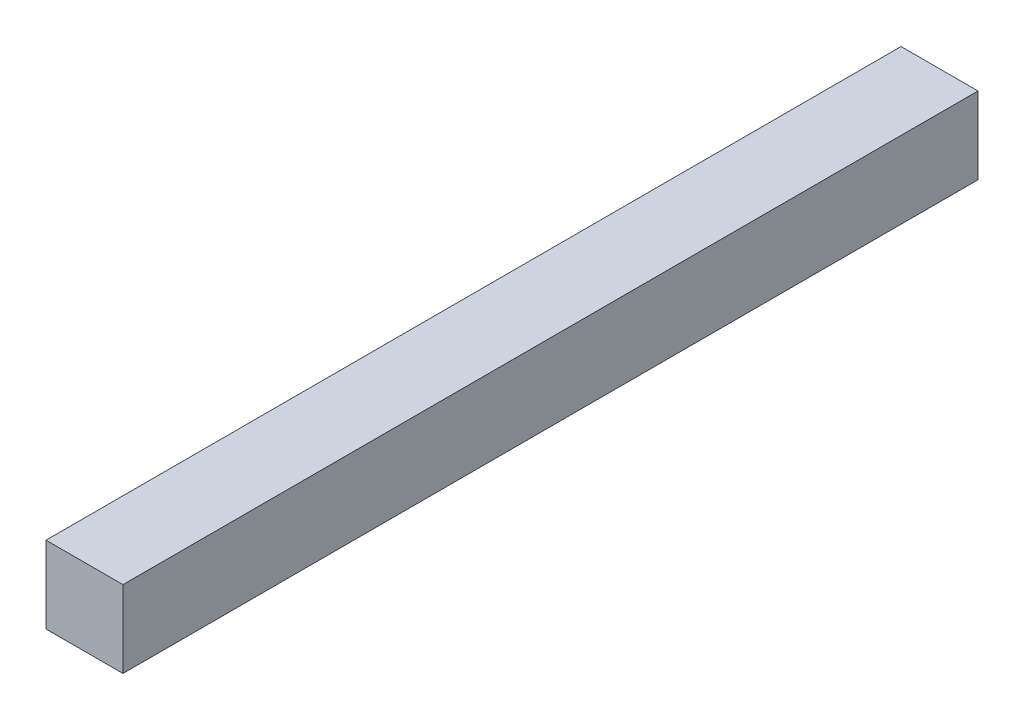
ISO-10303-21;
HEADER;
FILE_DESCRIPTION(('STEP AP214'),'2;1');
FILE_NAME('part.step','',(''),(''),'','','');
FILE_SCHEMA(('AUTOMOTIVE_DESIGN { 1 0 10303 214 1 1 1 1 }'));
ENDSEC;
DATA;
#1=APPLICATION_CONTEXT('core data for automotive mechanical design processes');
#2=APPLICATION_PROTOCOL_DEFINITION('international standard','automotive_design',2000,#1);
#3=PRODUCT_CONTEXT('',#1,'mechanical');
#4=PRODUCT('Part','Part','',(#3));
#5=PRODUCT_RELATED_PRODUCT_CATEGORY('part','',(#4));
#6=PRODUCT_DEFINITION_FORMATION('','',#4);
#7=PRODUCT_DEFINITION_CONTEXT('part definition',#1,'design');
#8=PRODUCT_DEFINITION('design','',#6,#7);
#9=PRODUCT_DEFINITION_SHAPE('','',#8);
#10=(LENGTH_UNIT() NAMED_UNIT(*) SI_UNIT(.MILLI.,.METRE.));
#11=(NAMED_UNIT(*) PLANE_ANGLE_UNIT() SI_UNIT($,.RADIAN.));
#12=(NAMED_UNIT(*) SI_UNIT($,.STERADIAN.) SOLID_ANGLE_UNIT());
#13=UNCERTAINTY_MEASURE_WITH_UNIT(LENGTH_MEASURE(1.E-05),#10,'distance_accuracy_value','');
#14=(GEOMETRIC_REPRESENTATION_CONTEXT(3) GLOBAL_UNCERTAINTY_ASSIGNED_CONTEXT((#13)) GLOBAL_UNIT_ASSIGNED_CONTEXT((#10,
#11,#12)) REPRESENTATION_CONTEXT('',''));
#15=CARTESIAN_POINT('',(0.,0.,0.));
#16=DIRECTION('',(0.,0.,1.));
#17=DIRECTION('',(1.,0.,0.));
#18=AXIS2_PLACEMENT_3D('',#15,#16,#17);
#19=CARTESIAN_POINT('',(0.,0.,-200.));
#20=DIRECTION('',(-1.,0.,0.));
#21=DIRECTION('',(0.,0.,1.));
#22=AXIS2_PLACEMENT_3D('',#19,#20,#21);
#23=PLANE('',#22);
#24=DIRECTION('',(0.,-1.,0.));
#25=VECTOR('',#24,1.);
#26=CARTESIAN_POINT('',(0.,0.,0.));
#27=LINE('',#26,#25);
#28=CARTESIAN_POINT('',(0.,18.,0.));
#29=VERTEX_POINT('',#28);
#30=CARTESIAN_POINT('',(0.,0.,0.));
#31=VERTEX_POINT('',#30);
#32=EDGE_CURVE('E95',#29,#31,#27,.T.);
#33=ORIENTED_EDGE('',*,*,#32,.F.);
#34=DIRECTION('',(0.,0.,1.));
#35=VECTOR('',#34,1.);
#36=CARTESIAN_POINT('',(0.,18.,-200.));
#37=LINE('',#36,#35);
#38=CARTESIAN_POINT('',(0.,18.,-200.));
#39=VERTEX_POINT('',#38);
#40=EDGE_CURVE('E11',#39,#29,#37,.T.);
#41=ORIENTED_EDGE('',*,*,#40,.F.);
#42=DIRECTION('',(0.,-1.,0.));
#43=VECTOR('',#42,1.);
#44=CARTESIAN_POINT('',(0.,0.,-200.));
#45=LINE('',#44,#43);
#46=CARTESIAN_POINT('',(0.,0.,-200.));
#47=VERTEX_POINT('',#46);
#48=EDGE_CURVE('E89',#39,#47,#45,.T.);
#49=ORIENTED_EDGE('',*,*,#48,.T.);
#50=DIRECTION('',(0.,0.,1.));
#51=VECTOR('',#50,1.);
#52=CARTESIAN_POINT('',(0.,0.,-200.));
#53=LINE('',#52,#51);
#54=EDGE_CURVE('E34',#47,#31,#53,.T.);
#55=ORIENTED_EDGE('',*,*,#54,.T.);
#56=EDGE_LOOP('',(#33,#41,#49,#55));
#57=FACE_BOUND('',#56,.T.);
#58=ADVANCED_FACE('F31',(#57),#23,.T.);
#59=CARTESIAN_POINT('',(0.,18.,-200.));
#60=DIRECTION('',(0.,1.,0.));
#61=DIRECTION('',(0.,0.,1.));
#62=AXIS2_PLACEMENT_3D('',#59,#60,#61);
#63=PLANE('',#62);
#64=DIRECTION('',(-1.,0.,0.));
#65=VECTOR('',#64,1.);
#66=CARTESIAN_POINT('',(0.,18.,0.));
#67=LINE('',#66,#65);
#68=CARTESIAN_POINT('',(18.,18.,0.));
#69=VERTEX_POINT('',#68);
#70=EDGE_CURVE('E91',#69,#29,#67,.T.);
#71=ORIENTED_EDGE('',*,*,#70,.F.);
#72=DIRECTION('',(0.,0.,1.));
#73=VECTOR('',#72,1.);
#74=CARTESIAN_POINT('',(18.,18.,-200.));
#75=LINE('',#74,#73);
#76=CARTESIAN_POINT('',(18.,18.,-200.));
#77=VERTEX_POINT('',#76);
#78=EDGE_CURVE('E40',#77,#69,#75,.T.);
#79=ORIENTED_EDGE('',*,*,#78,.F.);
#80=DIRECTION('',(-1.,0.,0.));
#81=VECTOR('',#80,1.);
#82=CARTESIAN_POINT('',(0.,18.,-200.));
#83=LINE('',#82,#81);
#84=EDGE_CURVE('E86',#77,#39,#83,.T.);
#85=ORIENTED_EDGE('',*,*,#84,.T.);
#86=ORIENTED_EDGE('',*,*,#40,.T.);
#87=EDGE_LOOP('',(#71,#79,#85,#86));
#88=FACE_BOUND('',#87,.T.);
#89=ADVANCED_FACE('F105',(#88),#63,.T.);
#90=CARTESIAN_POINT('',(18.,0.,-200.));
#91=DIRECTION('',(1.,0.,0.));
#92=DIRECTION('',(0.,0.,-1.));
#93=AXIS2_PLACEMENT_3D('',#90,#91,#92);
#94=PLANE('',#93);
#95=DIRECTION('',(0.,1.,0.));
#96=VECTOR('',#95,1.);
#97=CARTESIAN_POINT('',(18.,0.,0.));
#98=LINE('',#97,#96);
#99=CARTESIAN_POINT('',(18.,0.,0.));
#100=VERTEX_POINT('',#99);
#101=EDGE_CURVE('E81',#100,#69,#98,.T.);
#102=ORIENTED_EDGE('',*,*,#101,.F.);
#103=DIRECTION('',(0.,0.,1.));
#104=VECTOR('',#103,1.);
#105=CARTESIAN_POINT('',(18.,0.,-200.));
#106=LINE('',#105,#104);
#107=CARTESIAN_POINT('',(18.,0.,-200.));
#108=VERTEX_POINT('',#107);
#109=EDGE_CURVE('E76',#108,#100,#106,.T.);
#110=ORIENTED_EDGE('',*,*,#109,.F.);
#111=DIRECTION('',(0.,1.,0.));
#112=VECTOR('',#111,1.);
#113=CARTESIAN_POINT('',(18.,0.,-200.));
#114=LINE('',#113,#112);
#115=EDGE_CURVE('E79',#108,#77,#114,.T.);
#116=ORIENTED_EDGE('',*,*,#115,.T.);
#117=ORIENTED_EDGE('',*,*,#78,.T.);
#118=EDGE_LOOP('',(#102,#110,#116,#117));
#119=FACE_BOUND('',#118,.T.);
#120=ADVANCED_FACE('F78',(#119),#94,.T.);
#121=CARTESIAN_POINT('',(0.,0.,-200.));
#122=DIRECTION('',(0.,-1.,0.));
#123=DIRECTION('',(0.,0.,-1.));
#124=AXIS2_PLACEMENT_3D('',#121,#122,#123);
#125=PLANE('',#124);
#126=DIRECTION('',(1.,0.,0.));
#127=VECTOR('',#126,1.);
#128=CARTESIAN_POINT('',(0.,0.,0.));
#129=LINE('',#128,#127);
#130=EDGE_CURVE('E98',#31,#100,#129,.T.);
#131=ORIENTED_EDGE('',*,*,#130,.F.);
#132=ORIENTED_EDGE('',*,*,#54,.F.);
#133=DIRECTION('',(1.,0.,0.));
#134=VECTOR('',#133,1.);
#135=CARTESIAN_POINT('',(0.,0.,-200.));
#136=LINE('',#135,#134);
#137=EDGE_CURVE('E85',#47,#108,#136,.T.);
#138=ORIENTED_EDGE('',*,*,#137,.T.);
#139=ORIENTED_EDGE('',*,*,#109,.T.);
#140=EDGE_LOOP('',(#131,#132,#138,#139));
#141=FACE_BOUND('',#140,.T.);
#142=ADVANCED_FACE('F88',(#141),#125,.T.);
#143=CARTESIAN_POINT('',(0.,18.,-200.));
#144=DIRECTION('',(0.,0.,-1.));
#145=DIRECTION('',(-1.,0.,0.));
#146=AXIS2_PLACEMENT_3D('',#143,#144,#145);
#147=PLANE('',#146);
#148=ORIENTED_EDGE('',*,*,#48,.F.);
#149=ORIENTED_EDGE('',*,*,#84,.F.);
#150=ORIENTED_EDGE('',*,*,#115,.F.);
#151=ORIENTED_EDGE('',*,*,#137,.F.);
#152=EDGE_LOOP('',(#148,#149,#150,#151));
#153=FACE_BOUND('',#152,.T.);
#154=ADVANCED_FACE('F84',(#153),#147,.T.);
#155=CARTESIAN_POINT('',(0.,18.,0.));
#156=DIRECTION('',(0.,0.,-1.));
#157=DIRECTION('',(-1.,0.,0.));
#158=AXIS2_PLACEMENT_3D('',#155,#156,#157);
#159=PLANE('',#158);
#160=ORIENTED_EDGE('',*,*,#32,.T.);
#161=ORIENTED_EDGE('',*,*,#130,.T.);
#162=ORIENTED_EDGE('',*,*,#101,.T.);
#163=ORIENTED_EDGE('',*,*,#70,.T.);
#164=EDGE_LOOP('',(#160,#161,#162,#163));
#165=FACE_BOUND('',#164,.T.);
#166=ADVANCED_FACE('F104',(#165),#159,.F.);
#167=CLOSED_SHELL('',(#58,#89,#120,#142,#154,#166));
#168=MANIFOLD_SOLID_BREP('B2',#167);
#169=ADVANCED_BREP_SHAPE_REPRESENTATION('',(#18,#168),#14);
#170=SHAPE_DEFINITION_REPRESENTATION(#9,#169);
ENDSEC;
END-ISO-10303-21;
